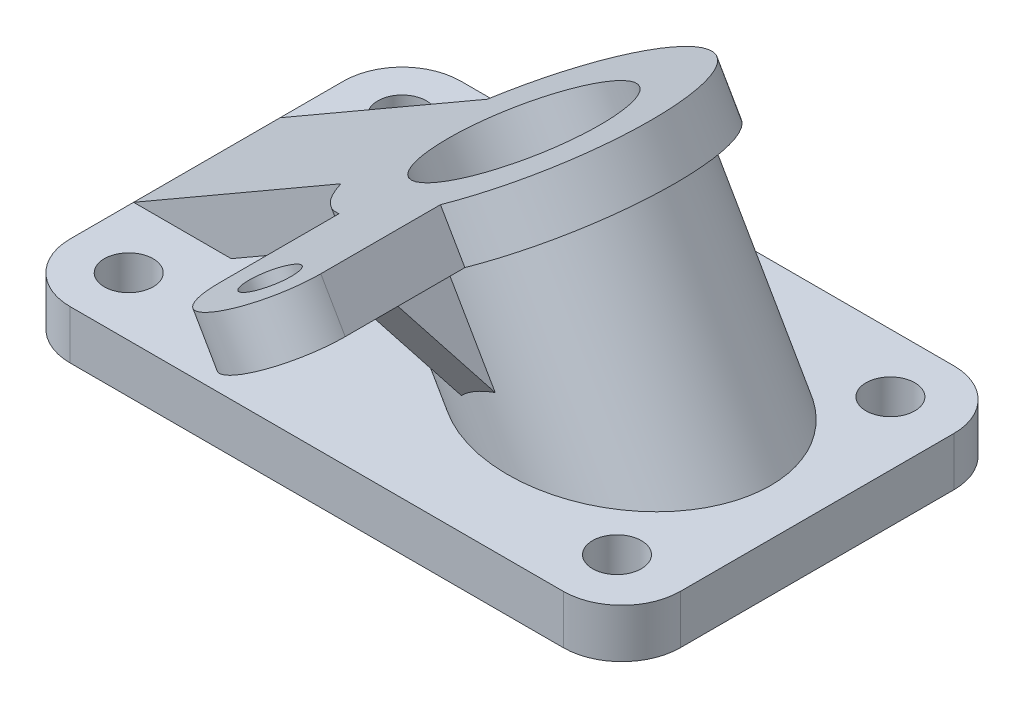
ISO-10303-21;
HEADER;
FILE_DESCRIPTION(('STEP AP214'),'2;1');
FILE_NAME('part.step','',(''),(''),'','','');
FILE_SCHEMA(('AUTOMOTIVE_DESIGN { 1 0 10303 214 1 1 1 1 }'));
ENDSEC;
DATA;
#1=APPLICATION_CONTEXT('core data for automotive mechanical design processes');
#2=APPLICATION_PROTOCOL_DEFINITION('international standard','automotive_design',2000,#1);
#3=PRODUCT_CONTEXT('',#1,'mechanical');
#4=PRODUCT('Part','Part','',(#3));
#5=PRODUCT_RELATED_PRODUCT_CATEGORY('part','',(#4));
#6=PRODUCT_DEFINITION_FORMATION('','',#4);
#7=PRODUCT_DEFINITION_CONTEXT('part definition',#1,'design');
#8=PRODUCT_DEFINITION('design','',#6,#7);
#9=PRODUCT_DEFINITION_SHAPE('','',#8);
#10=(LENGTH_UNIT() NAMED_UNIT(*) SI_UNIT(.MILLI.,.METRE.));
#11=(NAMED_UNIT(*) PLANE_ANGLE_UNIT() SI_UNIT($,.RADIAN.));
#12=(NAMED_UNIT(*) SI_UNIT($,.STERADIAN.) SOLID_ANGLE_UNIT());
#13=UNCERTAINTY_MEASURE_WITH_UNIT(LENGTH_MEASURE(1.E-05),#10,'distance_accuracy_value','');
#14=(GEOMETRIC_REPRESENTATION_CONTEXT(3) GLOBAL_UNCERTAINTY_ASSIGNED_CONTEXT((#13)) GLOBAL_UNIT_ASSIGNED_CONTEXT((#10,
#11,#12)) REPRESENTATION_CONTEXT('',''));
#15=CARTESIAN_POINT('',(0.,0.,0.));
#16=DIRECTION('',(0.,0.,1.));
#17=DIRECTION('',(1.,0.,0.));
#18=AXIS2_PLACEMENT_3D('',#15,#16,#17);
#19=CARTESIAN_POINT('',(-69.7085088742152,10.,-19.2976212814373));
#20=DIRECTION('',(0.,1.,0.));
#21=DIRECTION('',(0.,0.,1.));
#22=AXIS2_PLACEMENT_3D('',#19,#20,#21);
#23=PLANE('',#22);
#24=CARTESIAN_POINT('',(4.89403150419321,9.99999999999091,8.70237871856273));
#25=DIRECTION('',(0.,1.,0.));
#26=DIRECTION('',(-1.,0.,0.));
#27=AXIS2_PLACEMENT_3D('',#24,#25,#26);
#28=ELLIPSE('',#27,28.8675134594813,25.);
#29=CARTESIAN_POINT('',(-23.9734819552881,9.99999999999091,8.70237871856273));
#30=VERTEX_POINT('',#29);
#31=EDGE_CURVE('E349',#30,#30,#28,.T.);
#32=ORIENTED_EDGE('',*,*,#31,.F.);
#33=EDGE_LOOP('',(#32));
#34=FACE_BOUND('',#33,.T.);
#35=DIRECTION('',(-1.,0.,0.));
#36=VECTOR('',#35,1.);
#37=CARTESIAN_POINT('',(-69.7085088742152,10.,-6.29762128143727));
#38=LINE('',#37,#36);
#39=CARTESIAN_POINT('',(-61.7085088742152,10.,-6.29762128143727));
#40=VERTEX_POINT('',#39);
#41=CARTESIAN_POINT('',(-81.7085088742152,10.,-6.29762128143727));
#42=VERTEX_POINT('',#41);
#43=EDGE_CURVE('E261',#40,#42,#38,.T.);
#44=ORIENTED_EDGE('',*,*,#43,.F.);
#45=DIRECTION('',(0.,0.,1.));
#46=VECTOR('',#45,1.);
#47=CARTESIAN_POINT('',(-61.7085088742152,10.,-19.2976212814373));
#48=LINE('',#47,#46);
#49=CARTESIAN_POINT('',(-61.7085088742152,10.,23.7023787185627));
#50=VERTEX_POINT('',#49);
#51=EDGE_CURVE('E58',#40,#50,#48,.T.);
#52=ORIENTED_EDGE('',*,*,#51,.T.);
#53=DIRECTION('',(1.,0.,0.));
#54=VECTOR('',#53,1.);
#55=CARTESIAN_POINT('',(-69.7085088742152,10.,23.7023787185627));
#56=LINE('',#55,#54);
#57=CARTESIAN_POINT('',(-81.7085088742152,9.99999999999999,23.7023787185627));
#58=VERTEX_POINT('',#57);
#59=EDGE_CURVE('E250',#58,#50,#56,.T.);
#60=ORIENTED_EDGE('',*,*,#59,.F.);
#61=DIRECTION('',(0.,0.,1.));
#62=VECTOR('',#61,1.);
#63=CARTESIAN_POINT('',(-81.7085088742152,10.,-19.2976212814372));
#64=LINE('',#63,#62);
#65=CARTESIAN_POINT('',(-81.7085088742152,10.,36.7023787185626));
#66=VERTEX_POINT('',#65);
#67=EDGE_CURVE('E292',#58,#66,#64,.T.);
#68=ORIENTED_EDGE('',*,*,#67,.T.);
#69=CARTESIAN_POINT('',(-69.7085088742152,10.,36.7023787185627));
#70=DIRECTION('',(0.,1.,0.));
#71=DIRECTION('',(0.,0.,1.));
#72=AXIS2_PLACEMENT_3D('',#69,#70,#71);
#73=CIRCLE('',#72,12.);
#74=CARTESIAN_POINT('',(-69.7085088742151,10.,48.7023787185627));
#75=VERTEX_POINT('',#74);
#76=EDGE_CURVE('E297',#66,#75,#73,.T.);
#77=ORIENTED_EDGE('',*,*,#76,.T.);
#78=DIRECTION('',(1.,0.,0.));
#79=VECTOR('',#78,1.);
#80=CARTESIAN_POINT('',(-69.7085088742151,10.,48.7023787185627));
#81=LINE('',#80,#79);
#82=CARTESIAN_POINT('',(31.2914911257847,10.,48.7023787185627));
#83=VERTEX_POINT('',#82);
#84=EDGE_CURVE('E299',#75,#83,#81,.T.);
#85=ORIENTED_EDGE('',*,*,#84,.T.);
#86=CARTESIAN_POINT('',(31.2914911257848,10.,36.7023787185627));
#87=DIRECTION('',(0.,1.,0.));
#88=DIRECTION('',(0.,0.,1.));
#89=AXIS2_PLACEMENT_3D('',#86,#87,#88);
#90=CIRCLE('',#89,12.);
#91=CARTESIAN_POINT('',(43.2914911257848,10.,36.7023787185626));
#92=VERTEX_POINT('',#91);
#93=EDGE_CURVE('E301',#83,#92,#90,.T.);
#94=ORIENTED_EDGE('',*,*,#93,.T.);
#95=DIRECTION('',(0.,0.,-1.));
#96=VECTOR('',#95,1.);
#97=CARTESIAN_POINT('',(43.2914911257848,10.,-19.2976212814372));
#98=LINE('',#97,#96);
#99=CARTESIAN_POINT('',(43.2914911257848,10.,-19.2976212814372));
#100=VERTEX_POINT('',#99);
#101=EDGE_CURVE('E303',#92,#100,#98,.T.);
#102=ORIENTED_EDGE('',*,*,#101,.T.);
#103=CARTESIAN_POINT('',(31.2914911257848,10.,-19.2976212814373));
#104=DIRECTION('',(0.,1.,0.));
#105=DIRECTION('',(0.,0.,1.));
#106=AXIS2_PLACEMENT_3D('',#103,#104,#105);
#107=CIRCLE('',#106,12.);
#108=CARTESIAN_POINT('',(31.2914911257847,10.,-31.2976212814373));
#109=VERTEX_POINT('',#108);
#110=EDGE_CURVE('E305',#100,#109,#107,.T.);
#111=ORIENTED_EDGE('',*,*,#110,.T.);
#112=DIRECTION('',(-1.,0.,0.));
#113=VECTOR('',#112,1.);
#114=CARTESIAN_POINT('',(-69.7085088742151,10.,-31.2976212814373));
#115=LINE('',#114,#113);
#116=CARTESIAN_POINT('',(-69.7085088742151,10.,-31.2976212814373));
#117=VERTEX_POINT('',#116);
#118=EDGE_CURVE('E307',#109,#117,#115,.T.);
#119=ORIENTED_EDGE('',*,*,#118,.T.);
#120=CARTESIAN_POINT('',(-69.7085088742152,10.,-19.2976212814373));
#121=DIRECTION('',(0.,1.,0.));
#122=DIRECTION('',(0.,0.,1.));
#123=AXIS2_PLACEMENT_3D('',#120,#121,#122);
#124=CIRCLE('',#123,12.);
#125=CARTESIAN_POINT('',(-81.7085088742152,10.,-19.2976212814372));
#126=VERTEX_POINT('',#125);
#127=EDGE_CURVE('E289',#117,#126,#124,.T.);
#128=ORIENTED_EDGE('',*,*,#127,.T.);
#129=EDGE_CURVE('E294',#126,#42,#64,.T.);
#130=ORIENTED_EDGE('',*,*,#129,.T.);
#131=EDGE_LOOP('',(#44,#52,#60,#68,#77,#85,#94,#102,#111,#119,#128,#130));
#132=FACE_BOUND('',#131,.T.);
#133=CARTESIAN_POINT('',(30.2914911257846,10.,-19.2976212814373));
#134=DIRECTION('',(0.,1.,0.));
#135=DIRECTION('',(0.,0.,1.));
#136=AXIS2_PLACEMENT_3D('',#133,#134,#135);
#137=CIRCLE('',#136,5.00000000000001);
#138=CARTESIAN_POINT('',(30.2914911257846,10.,-14.2976212814373));
#139=VERTEX_POINT('',#138);
#140=EDGE_CURVE('E271',#139,#139,#137,.T.);
#141=ORIENTED_EDGE('',*,*,#140,.F.);
#142=EDGE_LOOP('',(#141));
#143=FACE_BOUND('',#142,.T.);
#144=CARTESIAN_POINT('',(-69.7085088742152,10.,36.7023787185627));
#145=DIRECTION('',(0.,1.,0.));
#146=DIRECTION('',(0.,0.,1.));
#147=AXIS2_PLACEMENT_3D('',#144,#145,#146);
#148=CIRCLE('',#147,5.00000000000001);
#149=CARTESIAN_POINT('',(-69.7085088742152,10.,41.7023787185627));
#150=VERTEX_POINT('',#149);
#151=EDGE_CURVE('E283',#150,#150,#148,.T.);
#152=ORIENTED_EDGE('',*,*,#151,.F.);
#153=EDGE_LOOP('',(#152));
#154=FACE_BOUND('',#153,.T.);
#155=CARTESIAN_POINT('',(30.2914911257848,10.,36.7023787185627));
#156=DIRECTION('',(0.,1.,0.));
#157=DIRECTION('',(0.,0.,1.));
#158=AXIS2_PLACEMENT_3D('',#155,#156,#157);
#159=CIRCLE('',#158,5.00000000000001);
#160=CARTESIAN_POINT('',(30.2914911257848,10.,41.7023787185627));
#161=VERTEX_POINT('',#160);
#162=EDGE_CURVE('E277',#161,#161,#159,.T.);
#163=ORIENTED_EDGE('',*,*,#162,.F.);
#164=EDGE_LOOP('',(#163));
#165=FACE_BOUND('',#164,.T.);
#166=CARTESIAN_POINT('',(-69.7085088742154,10.,-19.2976212814373));
#167=DIRECTION('',(0.,1.,0.));
#168=DIRECTION('',(0.,0.,1.));
#169=AXIS2_PLACEMENT_3D('',#166,#167,#168);
#170=CIRCLE('',#169,5.00000000000001);
#171=CARTESIAN_POINT('',(-69.7085088742154,10.,-14.2976212814373));
#172=VERTEX_POINT('',#171);
#173=EDGE_CURVE('E265',#172,#172,#170,.T.);
#174=ORIENTED_EDGE('',*,*,#173,.F.);
#175=EDGE_LOOP('',(#174));
#176=FACE_BOUND('',#175,.T.);
#177=ADVANCED_FACE('F35',(#34,#132,#143,#154,#165,#176),#23,.T.);
#178=CARTESIAN_POINT('',(-69.7085088742152,0.,-19.2976212814373));
#179=DIRECTION('',(0.,1.,0.));
#180=DIRECTION('',(0.,0.,1.));
#181=AXIS2_PLACEMENT_3D('',#178,#179,#180);
#182=PLANE('',#181);
#183=CARTESIAN_POINT('',(10.6675341961067,0.,8.70237871856273));
#184=DIRECTION('',(0.,1.,0.));
#185=DIRECTION('',(-1.,0.,0.));
#186=AXIS2_PLACEMENT_3D('',#183,#184,#185);
#187=ELLIPSE('',#186,20.7846096908266,18.);
#188=CARTESIAN_POINT('',(-10.1170754947198,0.,8.70237871856273));
#189=VERTEX_POINT('',#188);
#190=EDGE_CURVE('E193',#189,#189,#187,.T.);
#191=ORIENTED_EDGE('',*,*,#190,.T.);
#192=EDGE_LOOP('',(#191));
#193=FACE_BOUND('',#192,.T.);
#194=CARTESIAN_POINT('',(-69.7085088742152,0.,-19.2976212814373));
#195=DIRECTION('',(0.,1.,0.));
#196=DIRECTION('',(0.,0.,1.));
#197=AXIS2_PLACEMENT_3D('',#194,#195,#196);
#198=CIRCLE('',#197,12.);
#199=CARTESIAN_POINT('',(-69.7085088742151,0.,-31.2976212814373));
#200=VERTEX_POINT('',#199);
#201=CARTESIAN_POINT('',(-81.7085088742152,0.,-19.2976212814372));
#202=VERTEX_POINT('',#201);
#203=EDGE_CURVE('E286',#200,#202,#198,.T.);
#204=ORIENTED_EDGE('',*,*,#203,.F.);
#205=DIRECTION('',(-1.,0.,0.));
#206=VECTOR('',#205,1.);
#207=CARTESIAN_POINT('',(-69.7085088742151,0.,-31.2976212814373));
#208=LINE('',#207,#206);
#209=CARTESIAN_POINT('',(31.2914911257847,0.,-31.2976212814373));
#210=VERTEX_POINT('',#209);
#211=EDGE_CURVE('E293',#210,#200,#208,.T.);
#212=ORIENTED_EDGE('',*,*,#211,.F.);
#213=CARTESIAN_POINT('',(31.2914911257848,0.,-19.2976212814373));
#214=DIRECTION('',(0.,1.,0.));
#215=DIRECTION('',(0.,0.,1.));
#216=AXIS2_PLACEMENT_3D('',#213,#214,#215);
#217=CIRCLE('',#216,12.);
#218=CARTESIAN_POINT('',(43.2914911257848,0.,-19.2976212814372));
#219=VERTEX_POINT('',#218);
#220=EDGE_CURVE('E322',#219,#210,#217,.T.);
#221=ORIENTED_EDGE('',*,*,#220,.F.);
#222=DIRECTION('',(0.,0.,-1.));
#223=VECTOR('',#222,1.);
#224=CARTESIAN_POINT('',(43.2914911257848,0.,-19.2976212814372));
#225=LINE('',#224,#223);
#226=CARTESIAN_POINT('',(43.2914911257848,0.,36.7023787185626));
#227=VERTEX_POINT('',#226);
#228=EDGE_CURVE('E320',#227,#219,#225,.T.);
#229=ORIENTED_EDGE('',*,*,#228,.F.);
#230=CARTESIAN_POINT('',(31.2914911257848,0.,36.7023787185627));
#231=DIRECTION('',(0.,1.,0.));
#232=DIRECTION('',(0.,0.,1.));
#233=AXIS2_PLACEMENT_3D('',#230,#231,#232);
#234=CIRCLE('',#233,12.);
#235=CARTESIAN_POINT('',(31.2914911257847,0.,48.7023787185627));
#236=VERTEX_POINT('',#235);
#237=EDGE_CURVE('E318',#236,#227,#234,.T.);
#238=ORIENTED_EDGE('',*,*,#237,.F.);
#239=DIRECTION('',(1.,0.,0.));
#240=VECTOR('',#239,1.);
#241=CARTESIAN_POINT('',(-69.7085088742151,0.,48.7023787185627));
#242=LINE('',#241,#240);
#243=CARTESIAN_POINT('',(-69.7085088742151,0.,48.7023787185627));
#244=VERTEX_POINT('',#243);
#245=EDGE_CURVE('E316',#244,#236,#242,.T.);
#246=ORIENTED_EDGE('',*,*,#245,.F.);
#247=CARTESIAN_POINT('',(-69.7085088742152,0.,36.7023787185627));
#248=DIRECTION('',(0.,1.,0.));
#249=DIRECTION('',(0.,0.,1.));
#250=AXIS2_PLACEMENT_3D('',#247,#248,#249);
#251=CIRCLE('',#250,12.);
#252=CARTESIAN_POINT('',(-81.7085088742152,0.,36.7023787185626));
#253=VERTEX_POINT('',#252);
#254=EDGE_CURVE('E314',#253,#244,#251,.T.);
#255=ORIENTED_EDGE('',*,*,#254,.F.);
#256=DIRECTION('',(0.,0.,1.));
#257=VECTOR('',#256,1.);
#258=CARTESIAN_POINT('',(-81.7085088742152,0.,-19.2976212814372));
#259=LINE('',#258,#257);
#260=EDGE_CURVE('E312',#202,#253,#259,.T.);
#261=ORIENTED_EDGE('',*,*,#260,.F.);
#262=EDGE_LOOP('',(#204,#212,#221,#229,#238,#246,#255,#261));
#263=FACE_BOUND('',#262,.T.);
#264=CARTESIAN_POINT('',(-69.7085088742152,0.,36.7023787185627));
#265=DIRECTION('',(0.,1.,0.));
#266=DIRECTION('',(0.,0.,1.));
#267=AXIS2_PLACEMENT_3D('',#264,#265,#266);
#268=CIRCLE('',#267,5.00000000000001);
#269=CARTESIAN_POINT('',(-69.7085088742152,0.,41.7023787185627));
#270=VERTEX_POINT('',#269);
#271=EDGE_CURVE('E280',#270,#270,#268,.T.);
#272=ORIENTED_EDGE('',*,*,#271,.T.);
#273=EDGE_LOOP('',(#272));
#274=FACE_BOUND('',#273,.T.);
#275=CARTESIAN_POINT('',(30.2914911257848,0.,36.7023787185627));
#276=DIRECTION('',(0.,1.,0.));
#277=DIRECTION('',(0.,0.,1.));
#278=AXIS2_PLACEMENT_3D('',#275,#276,#277);
#279=CIRCLE('',#278,5.00000000000001);
#280=CARTESIAN_POINT('',(30.2914911257848,0.,41.7023787185627));
#281=VERTEX_POINT('',#280);
#282=EDGE_CURVE('E274',#281,#281,#279,.T.);
#283=ORIENTED_EDGE('',*,*,#282,.T.);
#284=EDGE_LOOP('',(#283));
#285=FACE_BOUND('',#284,.T.);
#286=CARTESIAN_POINT('',(30.2914911257846,0.,-19.2976212814373));
#287=DIRECTION('',(0.,1.,0.));
#288=DIRECTION('',(0.,0.,1.));
#289=AXIS2_PLACEMENT_3D('',#286,#287,#288);
#290=CIRCLE('',#289,5.00000000000001);
#291=CARTESIAN_POINT('',(30.2914911257846,0.,-14.2976212814373));
#292=VERTEX_POINT('',#291);
#293=EDGE_CURVE('E268',#292,#292,#290,.T.);
#294=ORIENTED_EDGE('',*,*,#293,.T.);
#295=EDGE_LOOP('',(#294));
#296=FACE_BOUND('',#295,.T.);
#297=CARTESIAN_POINT('',(-69.7085088742154,0.,-19.2976212814373));
#298=DIRECTION('',(0.,1.,0.));
#299=DIRECTION('',(0.,0.,1.));
#300=AXIS2_PLACEMENT_3D('',#297,#298,#299);
#301=CIRCLE('',#300,5.00000000000001);
#302=CARTESIAN_POINT('',(-69.7085088742154,0.,-14.2976212814373));
#303=VERTEX_POINT('',#302);
#304=EDGE_CURVE('E264',#303,#303,#301,.T.);
#305=ORIENTED_EDGE('',*,*,#304,.T.);
#306=EDGE_LOOP('',(#305));
#307=FACE_BOUND('',#306,.T.);
#308=ADVANCED_FACE('F366',(#193,#263,#274,#285,#296,#307),#182,.F.);
#309=CARTESIAN_POINT('',(-69.7085088742152,10.,-19.2976212814373));
#310=DIRECTION('',(0.,-1.,0.));
#311=DIRECTION('',(0.,0.,-1.));
#312=AXIS2_PLACEMENT_3D('',#309,#310,#311);
#313=CYLINDRICAL_SURFACE('',#312,12.);
#314=ORIENTED_EDGE('',*,*,#203,.T.);
#315=DIRECTION('',(0.,-1.,0.));
#316=VECTOR('',#315,1.);
#317=CARTESIAN_POINT('',(-81.7085088742152,10.,-19.2976212814372));
#318=LINE('',#317,#316);
#319=EDGE_CURVE('E345',#126,#202,#318,.T.);
#320=ORIENTED_EDGE('',*,*,#319,.F.);
#321=ORIENTED_EDGE('',*,*,#127,.F.);
#322=DIRECTION('',(0.,-1.,0.));
#323=VECTOR('',#322,1.);
#324=CARTESIAN_POINT('',(-69.7085088742151,10.,-31.2976212814373));
#325=LINE('',#324,#323);
#326=EDGE_CURVE('E309',#117,#200,#325,.T.);
#327=ORIENTED_EDGE('',*,*,#326,.T.);
#328=EDGE_LOOP('',(#314,#320,#321,#327));
#329=FACE_BOUND('',#328,.T.);
#330=ADVANCED_FACE('F37',(#329),#313,.T.);
#331=CARTESIAN_POINT('',(-81.7085088742152,10.,-19.2976212814372));
#332=DIRECTION('',(1.,0.,0.));
#333=DIRECTION('',(0.,0.,-1.));
#334=AXIS2_PLACEMENT_3D('',#331,#332,#333);
#335=PLANE('',#334);
#336=ORIENTED_EDGE('',*,*,#260,.T.);
#337=DIRECTION('',(0.,-1.,0.));
#338=VECTOR('',#337,1.);
#339=CARTESIAN_POINT('',(-81.7085088742152,10.,36.7023787185626));
#340=LINE('',#339,#338);
#341=EDGE_CURVE('E342',#66,#253,#340,.T.);
#342=ORIENTED_EDGE('',*,*,#341,.F.);
#343=ORIENTED_EDGE('',*,*,#67,.F.);
#344=DIRECTION('',(0.,0.,1.));
#345=VECTOR('',#344,1.);
#346=CARTESIAN_POINT('',(-81.7085088742152,9.99999999999999,-6.29762128143727));
#347=LINE('',#346,#345);
#348=EDGE_CURVE('E201',#42,#58,#347,.T.);
#349=ORIENTED_EDGE('',*,*,#348,.F.);
#350=ORIENTED_EDGE('',*,*,#129,.F.);
#351=ORIENTED_EDGE('',*,*,#319,.T.);
#352=EDGE_LOOP('',(#336,#342,#343,#349,#350,#351));
#353=FACE_BOUND('',#352,.T.);
#354=ADVANCED_FACE('F401',(#353),#335,.F.);
#355=CARTESIAN_POINT('',(-69.7085088742152,10.,36.7023787185627));
#356=DIRECTION('',(0.,-1.,0.));
#357=DIRECTION('',(0.,0.,-1.));
#358=AXIS2_PLACEMENT_3D('',#355,#356,#357);
#359=CYLINDRICAL_SURFACE('',#358,12.);
#360=ORIENTED_EDGE('',*,*,#254,.T.);
#361=DIRECTION('',(0.,-1.,0.));
#362=VECTOR('',#361,1.);
#363=CARTESIAN_POINT('',(-69.7085088742151,10.,48.7023787185627));
#364=LINE('',#363,#362);
#365=EDGE_CURVE('E339',#75,#244,#364,.T.);
#366=ORIENTED_EDGE('',*,*,#365,.F.);
#367=ORIENTED_EDGE('',*,*,#76,.F.);
#368=ORIENTED_EDGE('',*,*,#341,.T.);
#369=EDGE_LOOP('',(#360,#366,#367,#368));
#370=FACE_BOUND('',#369,.T.);
#371=ADVANCED_FACE('F398',(#370),#359,.T.);
#372=CARTESIAN_POINT('',(-69.7085088742151,10.,48.7023787185627));
#373=DIRECTION('',(0.,0.,-1.));
#374=DIRECTION('',(-1.,0.,0.));
#375=AXIS2_PLACEMENT_3D('',#372,#373,#374);
#376=PLANE('',#375);
#377=ORIENTED_EDGE('',*,*,#245,.T.);
#378=DIRECTION('',(0.,-1.,0.));
#379=VECTOR('',#378,1.);
#380=CARTESIAN_POINT('',(31.2914911257847,10.,48.7023787185627));
#381=LINE('',#380,#379);
#382=EDGE_CURVE('E336',#83,#236,#381,.T.);
#383=ORIENTED_EDGE('',*,*,#382,.F.);
#384=ORIENTED_EDGE('',*,*,#84,.F.);
#385=ORIENTED_EDGE('',*,*,#365,.T.);
#386=EDGE_LOOP('',(#377,#383,#384,#385));
#387=FACE_BOUND('',#386,.T.);
#388=ADVANCED_FACE('F394',(#387),#376,.F.);
#389=CARTESIAN_POINT('',(31.2914911257848,10.,36.7023787185627));
#390=DIRECTION('',(0.,-1.,0.));
#391=DIRECTION('',(0.,0.,-1.));
#392=AXIS2_PLACEMENT_3D('',#389,#390,#391);
#393=CYLINDRICAL_SURFACE('',#392,12.);
#394=ORIENTED_EDGE('',*,*,#237,.T.);
#395=DIRECTION('',(0.,-1.,0.));
#396=VECTOR('',#395,1.);
#397=CARTESIAN_POINT('',(43.2914911257848,10.,36.7023787185626));
#398=LINE('',#397,#396);
#399=EDGE_CURVE('E333',#92,#227,#398,.T.);
#400=ORIENTED_EDGE('',*,*,#399,.F.);
#401=ORIENTED_EDGE('',*,*,#93,.F.);
#402=ORIENTED_EDGE('',*,*,#382,.T.);
#403=EDGE_LOOP('',(#394,#400,#401,#402));
#404=FACE_BOUND('',#403,.T.);
#405=ADVANCED_FACE('F390',(#404),#393,.T.);
#406=CARTESIAN_POINT('',(43.2914911257848,10.,-19.2976212814372));
#407=DIRECTION('',(-1.,0.,0.));
#408=DIRECTION('',(0.,0.,1.));
#409=AXIS2_PLACEMENT_3D('',#406,#407,#408);
#410=PLANE('',#409);
#411=ORIENTED_EDGE('',*,*,#228,.T.);
#412=DIRECTION('',(0.,-1.,0.));
#413=VECTOR('',#412,1.);
#414=CARTESIAN_POINT('',(43.2914911257848,10.,-19.2976212814372));
#415=LINE('',#414,#413);
#416=EDGE_CURVE('E330',#100,#219,#415,.T.);
#417=ORIENTED_EDGE('',*,*,#416,.F.);
#418=ORIENTED_EDGE('',*,*,#101,.F.);
#419=ORIENTED_EDGE('',*,*,#399,.T.);
#420=EDGE_LOOP('',(#411,#417,#418,#419));
#421=FACE_BOUND('',#420,.T.);
#422=ADVANCED_FACE('F386',(#421),#410,.F.);
#423=CARTESIAN_POINT('',(31.2914911257848,10.,-19.2976212814373));
#424=DIRECTION('',(0.,-1.,0.));
#425=DIRECTION('',(0.,0.,-1.));
#426=AXIS2_PLACEMENT_3D('',#423,#424,#425);
#427=CYLINDRICAL_SURFACE('',#426,12.);
#428=ORIENTED_EDGE('',*,*,#220,.T.);
#429=DIRECTION('',(0.,-1.,0.));
#430=VECTOR('',#429,1.);
#431=CARTESIAN_POINT('',(31.2914911257847,10.,-31.2976212814373));
#432=LINE('',#431,#430);
#433=EDGE_CURVE('E327',#109,#210,#432,.T.);
#434=ORIENTED_EDGE('',*,*,#433,.F.);
#435=ORIENTED_EDGE('',*,*,#110,.F.);
#436=ORIENTED_EDGE('',*,*,#416,.T.);
#437=EDGE_LOOP('',(#428,#434,#435,#436));
#438=FACE_BOUND('',#437,.T.);
#439=ADVANCED_FACE('F382',(#438),#427,.T.);
#440=CARTESIAN_POINT('',(-69.7085088742151,10.,-31.2976212814373));
#441=DIRECTION('',(0.,0.,1.));
#442=DIRECTION('',(1.,0.,0.));
#443=AXIS2_PLACEMENT_3D('',#440,#441,#442);
#444=PLANE('',#443);
#445=ORIENTED_EDGE('',*,*,#211,.T.);
#446=ORIENTED_EDGE('',*,*,#326,.F.);
#447=ORIENTED_EDGE('',*,*,#118,.F.);
#448=ORIENTED_EDGE('',*,*,#433,.T.);
#449=EDGE_LOOP('',(#445,#446,#447,#448));
#450=FACE_BOUND('',#449,.T.);
#451=ADVANCED_FACE('F379',(#450),#444,.F.);
#452=CARTESIAN_POINT('',(-69.7085088742152,10.,36.7023787185627));
#453=DIRECTION('',(0.,-1.,0.));
#454=DIRECTION('',(0.,0.,-1.));
#455=AXIS2_PLACEMENT_3D('',#452,#453,#454);
#456=CYLINDRICAL_SURFACE('',#455,5.00000000000001);
#457=ORIENTED_EDGE('',*,*,#151,.T.);
#458=EDGE_LOOP('',(#457));
#459=FACE_BOUND('',#458,.T.);
#460=ORIENTED_EDGE('',*,*,#271,.F.);
#461=EDGE_LOOP('',(#460));
#462=FACE_BOUND('',#461,.T.);
#463=ADVANCED_FACE('F376',(#459,#462),#456,.F.);
#464=CARTESIAN_POINT('',(30.2914911257848,10.,36.7023787185627));
#465=DIRECTION('',(0.,-1.,0.));
#466=DIRECTION('',(0.,0.,-1.));
#467=AXIS2_PLACEMENT_3D('',#464,#465,#466);
#468=CYLINDRICAL_SURFACE('',#467,5.00000000000001);
#469=ORIENTED_EDGE('',*,*,#162,.T.);
#470=EDGE_LOOP('',(#469));
#471=FACE_BOUND('',#470,.T.);
#472=ORIENTED_EDGE('',*,*,#282,.F.);
#473=EDGE_LOOP('',(#472));
#474=FACE_BOUND('',#473,.T.);
#475=ADVANCED_FACE('F482',(#471,#474),#468,.F.);
#476=CARTESIAN_POINT('',(30.2914911257846,10.,-19.2976212814373));
#477=DIRECTION('',(0.,-1.,0.));
#478=DIRECTION('',(0.,0.,-1.));
#479=AXIS2_PLACEMENT_3D('',#476,#477,#478);
#480=CYLINDRICAL_SURFACE('',#479,5.00000000000001);
#481=ORIENTED_EDGE('',*,*,#140,.T.);
#482=EDGE_LOOP('',(#481));
#483=FACE_BOUND('',#482,.T.);
#484=ORIENTED_EDGE('',*,*,#293,.F.);
#485=EDGE_LOOP('',(#484));
#486=FACE_BOUND('',#485,.T.);
#487=ADVANCED_FACE('F479',(#483,#486),#480,.F.);
#488=CARTESIAN_POINT('',(-69.7085088742154,10.,-19.2976212814373));
#489=DIRECTION('',(0.,-1.,0.));
#490=DIRECTION('',(0.,0.,-1.));
#491=AXIS2_PLACEMENT_3D('',#488,#489,#490);
#492=CYLINDRICAL_SURFACE('',#491,5.00000000000001);
#493=ORIENTED_EDGE('',*,*,#173,.T.);
#494=EDGE_LOOP('',(#493));
#495=FACE_BOUND('',#494,.T.);
#496=ORIENTED_EDGE('',*,*,#304,.F.);
#497=EDGE_LOOP('',(#496));
#498=FACE_BOUND('',#497,.T.);
#499=ADVANCED_FACE('F476',(#495,#498),#492,.F.);
#500=CARTESIAN_POINT('',(-76.7085088742152,1.33974596215561,-6.29762128143727));
#501=DIRECTION('',(0.,0.,-1.));
#502=DIRECTION('',(-1.,0.,0.));
#503=AXIS2_PLACEMENT_3D('',#500,#501,#502);
#504=PLANE('',#503);
#505=DIRECTION('',(-0.866025403784438,-0.500000000000001,0.));
#506=VECTOR('',#505,1.);
#507=CARTESIAN_POINT('',(-76.7085088742152,1.33974596215561,-6.29762128143727));
#508=LINE('',#507,#506);
#509=CARTESIAN_POINT('',(-34.2566035903823,25.8493649053891,-6.29762128143728));
#510=VERTEX_POINT('',#509);
#511=EDGE_CURVE('E222',#510,#40,#508,.T.);
#512=ORIENTED_EDGE('',*,*,#511,.T.);
#513=ORIENTED_EDGE('',*,*,#43,.T.);
#514=DIRECTION('',(-0.866025403784438,-0.500000000000001,0.));
#515=VECTOR('',#514,1.);
#516=CARTESIAN_POINT('',(-81.7085088742152,9.99999999999999,-6.29762128143727));
#517=LINE('',#516,#515);
#518=CARTESIAN_POINT('',(-39.2566035903823,34.5096189432335,-6.29762128143728));
#519=VERTEX_POINT('',#518);
#520=EDGE_CURVE('E207',#519,#42,#517,.T.);
#521=ORIENTED_EDGE('',*,*,#520,.F.);
#522=DIRECTION('',(-0.500000000000001,0.866025403784438,0.));
#523=VECTOR('',#522,1.);
#524=CARTESIAN_POINT('',(-34.2566035903823,25.8493649053891,-6.29762128143728));
#525=LINE('',#524,#523);
#526=EDGE_CURVE('E248',#510,#519,#525,.T.);
#527=ORIENTED_EDGE('',*,*,#526,.F.);
#528=EDGE_LOOP('',(#512,#513,#521,#527));
#529=FACE_BOUND('',#528,.T.);
#530=ADVANCED_FACE('F432',(#529),#504,.T.);
#531=CARTESIAN_POINT('',(-11.7566035903823,38.8397459621557,8.70237871856273));
#532=DIRECTION('',(-0.500000000000001,0.866025403784438,0.));
#533=DIRECTION('',(-0.866025403784438,-0.500000000000001,0.));
#534=AXIS2_PLACEMENT_3D('',#531,#532,#533);
#535=CYLINDRICAL_SURFACE('',#534,30.);
#536=CARTESIAN_POINT('',(-16.7566035903823,47.5000000000001,8.70237871856273));
#537=DIRECTION('',(-0.500000000000001,0.866025403784438,0.));
#538=DIRECTION('',(-0.866025403784438,-0.500000000000001,0.));
#539=AXIS2_PLACEMENT_3D('',#536,#537,#538);
#540=CIRCLE('',#539,30.);
#541=CARTESIAN_POINT('',(-6.36429874496909,53.5000000000001,36.1978328882978));
#542=VERTEX_POINT('',#541);
#543=EDGE_CURVE('E243',#542,#519,#540,.T.);
#544=ORIENTED_EDGE('',*,*,#543,.F.);
#545=DIRECTION('',(-0.500000000000001,0.866025403784438,0.));
#546=VECTOR('',#545,1.);
#547=CARTESIAN_POINT('',(-1.36429874496908,44.8397459621557,36.1978328882978));
#548=LINE('',#547,#546);
#549=CARTESIAN_POINT('',(-1.36429874496908,44.8397459621557,36.1978328882978));
#550=VERTEX_POINT('',#549);
#551=EDGE_CURVE('E251',#550,#542,#548,.T.);
#552=ORIENTED_EDGE('',*,*,#551,.F.);
#553=CARTESIAN_POINT('',(-11.7566035903823,38.8397459621557,8.70237871856273));
#554=DIRECTION('',(-0.500000000000001,0.866025403784438,0.));
#555=DIRECTION('',(-0.866025403784438,-0.500000000000001,0.));
#556=AXIS2_PLACEMENT_3D('',#553,#554,#555);
#557=CIRCLE('',#556,30.);
#558=EDGE_CURVE('E219',#550,#510,#557,.T.);
#559=ORIENTED_EDGE('',*,*,#558,.T.);
#560=ORIENTED_EDGE('',*,*,#526,.T.);
#561=EDGE_LOOP('',(#544,#552,#559,#560));
#562=FACE_BOUND('',#561,.T.);
#563=ADVANCED_FACE('F438',(#562),#535,.T.);
#564=CARTESIAN_POINT('',(-1.36429874496908,44.8397459621557,36.1978328882978));
#565=DIRECTION('',(0.866025403784438,0.500000000000001,0.));
#566=DIRECTION('',(-0.500000000000001,0.866025403784438,0.));
#567=AXIS2_PLACEMENT_3D('',#564,#565,#566);
#568=PLANE('',#567);
#569=DIRECTION('',(0.,0.,-1.));
#570=VECTOR('',#569,1.);
#571=CARTESIAN_POINT('',(-6.36429874496909,53.5000000000001,36.1978328882978));
#572=LINE('',#571,#570);
#573=CARTESIAN_POINT('',(-6.36429874496909,53.5000000000001,60.7023787185627));
#574=VERTEX_POINT('',#573);
#575=EDGE_CURVE('E240',#574,#542,#572,.T.);
#576=ORIENTED_EDGE('',*,*,#575,.F.);
#577=DIRECTION('',(-0.500000000000001,0.866025403784438,0.));
#578=VECTOR('',#577,1.);
#579=CARTESIAN_POINT('',(-1.36429874496908,44.8397459621557,60.7023787185627));
#580=LINE('',#579,#578);
#581=CARTESIAN_POINT('',(-1.36429874496908,44.8397459621557,60.7023787185627));
#582=VERTEX_POINT('',#581);
#583=EDGE_CURVE('E253',#582,#574,#580,.T.);
#584=ORIENTED_EDGE('',*,*,#583,.F.);
#585=DIRECTION('',(0.,0.,-1.));
#586=VECTOR('',#585,1.);
#587=CARTESIAN_POINT('',(-1.36429874496908,44.8397459621557,36.1978328882978));
#588=LINE('',#587,#586);
#589=EDGE_CURVE('E216',#582,#550,#588,.T.);
#590=ORIENTED_EDGE('',*,*,#589,.T.);
#591=ORIENTED_EDGE('',*,*,#551,.T.);
#592=EDGE_LOOP('',(#576,#584,#590,#591));
#593=FACE_BOUND('',#592,.T.);
#594=ADVANCED_FACE('F459',(#593),#568,.T.);
#595=CARTESIAN_POINT('',(-11.7566035903823,38.8397459621557,60.7023787185627));
#596=DIRECTION('',(-0.500000000000001,0.866025403784438,0.));
#597=DIRECTION('',(-0.866025403784438,-0.500000000000001,0.));
#598=AXIS2_PLACEMENT_3D('',#595,#596,#597);
#599=CYLINDRICAL_SURFACE('',#598,12.);
#600=CARTESIAN_POINT('',(-16.7566035903823,47.5000000000001,60.7023787185627));
#601=DIRECTION('',(-0.500000000000001,0.866025403784438,0.));
#602=DIRECTION('',(0.866025403784438,0.500000000000001,0.));
#603=AXIS2_PLACEMENT_3D('',#600,#601,#602);
#604=CIRCLE('',#603,12.);
#605=CARTESIAN_POINT('',(-27.1489084357956,41.5000000000001,60.7023787185627));
#606=VERTEX_POINT('',#605);
#607=EDGE_CURVE('E237',#606,#574,#604,.T.);
#608=ORIENTED_EDGE('',*,*,#607,.F.);
#609=DIRECTION('',(-0.500000000000001,0.866025403784438,0.));
#610=VECTOR('',#609,1.);
#611=CARTESIAN_POINT('',(-22.1489084357956,32.8397459621557,60.7023787185627));
#612=LINE('',#611,#610);
#613=CARTESIAN_POINT('',(-22.1489084357956,32.8397459621557,60.7023787185627));
#614=VERTEX_POINT('',#613);
#615=EDGE_CURVE('E255',#614,#606,#612,.T.);
#616=ORIENTED_EDGE('',*,*,#615,.F.);
#617=CARTESIAN_POINT('',(-11.7566035903823,38.8397459621557,60.7023787185627));
#618=DIRECTION('',(-0.500000000000001,0.866025403784438,0.));
#619=DIRECTION('',(0.866025403784438,0.500000000000001,0.));
#620=AXIS2_PLACEMENT_3D('',#617,#618,#619);
#621=CIRCLE('',#620,12.);
#622=EDGE_CURVE('E213',#614,#582,#621,.T.);
#623=ORIENTED_EDGE('',*,*,#622,.T.);
#624=ORIENTED_EDGE('',*,*,#583,.T.);
#625=EDGE_LOOP('',(#608,#616,#623,#624));
#626=FACE_BOUND('',#625,.T.);
#627=ADVANCED_FACE('F457',(#626),#599,.T.);
#628=CARTESIAN_POINT('',(-22.1489084357956,32.8397459621557,36.1978328882978));
#629=DIRECTION('',(-0.866025403784438,-0.500000000000001,0.));
#630=DIRECTION('',(0.500000000000001,-0.866025403784438,0.));
#631=AXIS2_PLACEMENT_3D('',#628,#629,#630);
#632=PLANE('',#631);
#633=DIRECTION('',(0.,0.,1.));
#634=VECTOR('',#633,1.);
#635=CARTESIAN_POINT('',(-27.1489084357956,41.5000000000001,36.1978328882978));
#636=LINE('',#635,#634);
#637=CARTESIAN_POINT('',(-27.1489084357956,41.5000000000001,36.1978328882978));
#638=VERTEX_POINT('',#637);
#639=EDGE_CURVE('E234',#638,#606,#636,.T.);
#640=ORIENTED_EDGE('',*,*,#639,.F.);
#641=DIRECTION('',(-0.500000000000001,0.866025403784438,0.));
#642=VECTOR('',#641,1.);
#643=CARTESIAN_POINT('',(-22.1489084357956,32.8397459621557,36.1978328882978));
#644=LINE('',#643,#642);
#645=CARTESIAN_POINT('',(-22.1489084357956,32.8397459621557,36.1978328882978));
#646=VERTEX_POINT('',#645);
#647=EDGE_CURVE('E257',#646,#638,#644,.T.);
#648=ORIENTED_EDGE('',*,*,#647,.F.);
#649=DIRECTION('',(0.,0.,1.));
#650=VECTOR('',#649,1.);
#651=CARTESIAN_POINT('',(-22.1489084357956,32.8397459621557,36.1978328882978));
#652=LINE('',#651,#650);
#653=EDGE_CURVE('E210',#646,#614,#652,.T.);
#654=ORIENTED_EDGE('',*,*,#653,.T.);
#655=ORIENTED_EDGE('',*,*,#615,.T.);
#656=EDGE_LOOP('',(#640,#648,#654,#655));
#657=FACE_BOUND('',#656,.T.);
#658=ADVANCED_FACE('F454',(#657),#632,.T.);
#659=CARTESIAN_POINT('',(-11.7566035903823,38.8397459621557,8.70237871856273));
#660=DIRECTION('',(-0.500000000000001,0.866025403784438,0.));
#661=DIRECTION('',(-0.866025403784438,-0.500000000000001,0.));
#662=AXIS2_PLACEMENT_3D('',#659,#660,#661);
#663=CYLINDRICAL_SURFACE('',#662,30.);
#664=CARTESIAN_POINT('',(-16.7566035903823,47.5000000000001,8.70237871856273));
#665=DIRECTION('',(-0.500000000000001,0.866025403784438,0.));
#666=DIRECTION('',(-0.866025403784438,-0.500000000000001,0.));
#667=AXIS2_PLACEMENT_3D('',#664,#665,#666);
#668=CIRCLE('',#667,30.);
#669=CARTESIAN_POINT('',(-39.2566035903823,34.5096189432335,23.7023787185627));
#670=VERTEX_POINT('',#669);
#671=EDGE_CURVE('E231',#670,#638,#668,.T.);
#672=ORIENTED_EDGE('',*,*,#671,.F.);
#673=DIRECTION('',(-0.500000000000001,0.866025403784438,0.));
#674=VECTOR('',#673,1.);
#675=CARTESIAN_POINT('',(-34.2566035903823,25.8493649053891,23.7023787185627));
#676=LINE('',#675,#674);
#677=CARTESIAN_POINT('',(-34.2566035903823,25.8493649053891,23.7023787185627));
#678=VERTEX_POINT('',#677);
#679=EDGE_CURVE('E225',#678,#670,#676,.T.);
#680=ORIENTED_EDGE('',*,*,#679,.F.);
#681=CARTESIAN_POINT('',(-11.7566035903823,38.8397459621557,8.70237871856273));
#682=DIRECTION('',(-0.500000000000001,0.866025403784438,0.));
#683=DIRECTION('',(-0.866025403784438,-0.500000000000001,0.));
#684=AXIS2_PLACEMENT_3D('',#681,#682,#683);
#685=CIRCLE('',#684,30.);
#686=EDGE_CURVE('E206',#678,#646,#685,.T.);
#687=ORIENTED_EDGE('',*,*,#686,.T.);
#688=ORIENTED_EDGE('',*,*,#647,.T.);
#689=EDGE_LOOP('',(#672,#680,#687,#688));
#690=FACE_BOUND('',#689,.T.);
#691=ADVANCED_FACE('F450',(#690),#663,.T.);
#692=CARTESIAN_POINT('',(-76.7085088742152,1.33974596215561,23.7023787185627));
#693=DIRECTION('',(0.,0.,1.));
#694=DIRECTION('',(1.,0.,0.));
#695=AXIS2_PLACEMENT_3D('',#692,#693,#694);
#696=PLANE('',#695);
#697=DIRECTION('',(0.866025403784438,0.500000000000001,0.));
#698=VECTOR('',#697,1.);
#699=CARTESIAN_POINT('',(-81.7085088742152,9.99999999999999,23.7023787185627));
#700=LINE('',#699,#698);
#701=EDGE_CURVE('E228',#58,#670,#700,.T.);
#702=ORIENTED_EDGE('',*,*,#701,.F.);
#703=ORIENTED_EDGE('',*,*,#59,.T.);
#704=DIRECTION('',(0.866025403784438,0.500000000000001,0.));
#705=VECTOR('',#704,1.);
#706=CARTESIAN_POINT('',(-76.7085088742152,1.33974596215561,23.7023787185627));
#707=LINE('',#706,#705);
#708=EDGE_CURVE('E204',#50,#678,#707,.T.);
#709=ORIENTED_EDGE('',*,*,#708,.T.);
#710=ORIENTED_EDGE('',*,*,#679,.T.);
#711=EDGE_LOOP('',(#702,#703,#709,#710));
#712=FACE_BOUND('',#711,.T.);
#713=ADVANCED_FACE('F447',(#712),#696,.T.);
#714=CARTESIAN_POINT('',(-11.7566035903823,38.8397459621557,8.70237871856273));
#715=DIRECTION('',(-0.500000000000001,0.866025403784438,0.));
#716=DIRECTION('',(-0.866025403784438,-0.500000000000001,0.));
#717=AXIS2_PLACEMENT_3D('',#714,#715,#716);
#718=PLANE('',#717);
#719=CARTESIAN_POINT('',(-11.7566035903565,38.8397459620364,8.70237871856273));
#720=DIRECTION('',(-0.500000000000001,0.866025403784438,0.));
#721=DIRECTION('',(-0.866025403784438,-0.500000000000001,0.));
#722=AXIS2_PLACEMENT_3D('',#719,#720,#721);
#723=CIRCLE('',#722,25.);
#724=CARTESIAN_POINT('',(-15.2207052054692,36.8397459620509,33.3803040770509));
#725=VERTEX_POINT('',#724);
#726=CARTESIAN_POINT('',(-8.29250197519367,40.8397459620509,33.3803040770896));
#727=VERTEX_POINT('',#726);
#728=EDGE_CURVE('E185',#725,#727,#723,.F.);
#729=ORIENTED_EDGE('',*,*,#728,.F.);
#730=DIRECTION('',(-2.63741386265529E-13,-1.51617251312714E-13,-1.));
#731=VECTOR('',#730,1.);
#732=CARTESIAN_POINT('',(-15.220705205466,36.8397459620527,45.2977209007754));
#733=LINE('',#732,#731);
#734=CARTESIAN_POINT('',(-15.220705205466,36.8397459620527,45.2977209007754));
#735=VERTEX_POINT('',#734);
#736=EDGE_CURVE('E178',#735,#725,#733,.T.);
#737=ORIENTED_EDGE('',*,*,#736,.F.);
#738=DIRECTION('',(0.866025403784438,0.500000000000001,-3.04421710219233E-13));
#739=VECTOR('',#738,1.);
#740=CARTESIAN_POINT('',(-15.220705205466,36.8397459620527,45.2977209007754));
#741=LINE('',#740,#739);
#742=CARTESIAN_POINT('',(-8.29250197519053,40.8397459620527,45.297720900773));
#743=VERTEX_POINT('',#742);
#744=EDGE_CURVE('E166',#735,#743,#741,.T.);
#745=ORIENTED_EDGE('',*,*,#744,.T.);
#746=DIRECTION('',(-2.63741386265529E-13,-1.51617251312714E-13,-1.));
#747=VECTOR('',#746,1.);
#748=CARTESIAN_POINT('',(-8.29250197519053,40.8397459620527,45.297720900773));
#749=LINE('',#748,#747);
#750=EDGE_CURVE('E187',#743,#727,#749,.T.);
#751=ORIENTED_EDGE('',*,*,#750,.T.);
#752=EDGE_LOOP('',(#729,#737,#745,#751));
#753=FACE_BOUND('',#752,.T.);
#754=ORIENTED_EDGE('',*,*,#51,.F.);
#755=ORIENTED_EDGE('',*,*,#511,.F.);
#756=ORIENTED_EDGE('',*,*,#558,.F.);
#757=ORIENTED_EDGE('',*,*,#589,.F.);
#758=ORIENTED_EDGE('',*,*,#622,.F.);
#759=ORIENTED_EDGE('',*,*,#653,.F.);
#760=ORIENTED_EDGE('',*,*,#686,.F.);
#761=ORIENTED_EDGE('',*,*,#708,.F.);
#762=EDGE_LOOP('',(#754,#755,#756,#757,#758,#759,#760,#761));
#763=FACE_BOUND('',#762,.T.);
#764=CARTESIAN_POINT('',(-11.7566035903823,38.8397459621557,60.7023787185627));
#765=DIRECTION('',(-0.500000000000001,0.866025403784438,0.));
#766=DIRECTION('',(-0.866025403784438,-0.500000000000001,0.));
#767=AXIS2_PLACEMENT_3D('',#764,#765,#766);
#768=CIRCLE('',#767,5.);
#769=CARTESIAN_POINT('',(-16.0867306093045,36.3397459621557,60.7023787185627));
#770=VERTEX_POINT('',#769);
#771=EDGE_CURVE('E198',#770,#770,#768,.T.);
#772=ORIENTED_EDGE('',*,*,#771,.T.);
#773=EDGE_LOOP('',(#772));
#774=FACE_BOUND('',#773,.T.);
#775=ADVANCED_FACE('F182',(#753,#763,#774),#718,.F.);
#776=CARTESIAN_POINT('',(-16.7566035903823,47.5000000000001,8.70237871856273));
#777=DIRECTION('',(-0.500000000000001,0.866025403784438,0.));
#778=DIRECTION('',(-0.866025403784438,-0.500000000000001,0.));
#779=AXIS2_PLACEMENT_3D('',#776,#777,#778);
#780=PLANE('',#779);
#781=CARTESIAN_POINT('',(-16.7566035903961,47.4999999999922,8.70237871856273));
#782=DIRECTION('',(-0.500000000000001,0.866025403784438,0.));
#783=DIRECTION('',(-0.866025403784438,-0.500000000000001,0.));
#784=AXIS2_PLACEMENT_3D('',#781,#782,#783);
#785=CIRCLE('',#784,18.);
#786=CARTESIAN_POINT('',(-32.345060858516,38.4999999999921,8.70237871856273));
#787=VERTEX_POINT('',#786);
#788=EDGE_CURVE('E174',#787,#787,#785,.T.);
#789=ORIENTED_EDGE('',*,*,#788,.F.);
#790=EDGE_LOOP('',(#789));
#791=FACE_BOUND('',#790,.T.);
#792=CARTESIAN_POINT('',(-16.7566035903823,47.5000000000001,60.7023787185627));
#793=DIRECTION('',(-0.500000000000001,0.866025403784438,0.));
#794=DIRECTION('',(-0.866025403784438,-0.500000000000001,0.));
#795=AXIS2_PLACEMENT_3D('',#792,#793,#794);
#796=CIRCLE('',#795,5.);
#797=CARTESIAN_POINT('',(-21.0867306093045,45.0000000000001,60.7023787185627));
#798=VERTEX_POINT('',#797);
#799=EDGE_CURVE('E197',#798,#798,#796,.T.);
#800=ORIENTED_EDGE('',*,*,#799,.F.);
#801=EDGE_LOOP('',(#800));
#802=FACE_BOUND('',#801,.T.);
#803=ORIENTED_EDGE('',*,*,#348,.T.);
#804=ORIENTED_EDGE('',*,*,#701,.T.);
#805=ORIENTED_EDGE('',*,*,#671,.T.);
#806=ORIENTED_EDGE('',*,*,#639,.T.);
#807=ORIENTED_EDGE('',*,*,#607,.T.);
#808=ORIENTED_EDGE('',*,*,#575,.T.);
#809=ORIENTED_EDGE('',*,*,#543,.T.);
#810=ORIENTED_EDGE('',*,*,#520,.T.);
#811=EDGE_LOOP('',(#803,#804,#805,#806,#807,#808,#809,#810));
#812=FACE_BOUND('',#811,.T.);
#813=ADVANCED_FACE('F434',(#791,#802,#812),#780,.T.);
#814=CARTESIAN_POINT('',(-11.7566035903823,38.8397459621557,60.7023787185627));
#815=DIRECTION('',(-0.500000000000001,0.866025403784438,0.));
#816=DIRECTION('',(-0.866025403784438,-0.500000000000001,0.));
#817=AXIS2_PLACEMENT_3D('',#814,#815,#816);
#818=CYLINDRICAL_SURFACE('',#817,5.);
#819=ORIENTED_EDGE('',*,*,#771,.F.);
#820=EDGE_LOOP('',(#819));
#821=FACE_BOUND('',#820,.T.);
#822=ORIENTED_EDGE('',*,*,#799,.T.);
#823=EDGE_LOOP('',(#822));
#824=FACE_BOUND('',#823,.T.);
#825=ADVANCED_FACE('F558',(#821,#824),#818,.F.);
#826=CARTESIAN_POINT('',(288678.585250645,-499987.5,8.70237871856273));
#827=DIRECTION('',(-0.500000000000001,0.866025403784438,0.));
#828=DIRECTION('',(-0.866025403784438,-0.500000000000001,0.));
#829=AXIS2_PLACEMENT_3D('',#826,#827,#828);
#830=CYLINDRICAL_SURFACE('',#829,25.);
#831=DIRECTION('',(-0.500000000000001,0.866025403784438,0.));
#832=VECTOR('',#831,1.);
#833=CARTESIAN_POINT('',(288675.12114903,-499989.5,33.3803040770509));
#834=LINE('',#833,#832);
#835=CARTESIAN_POINT('',(-4.89991948866692,18.9636207263794,33.3803040770456));
#836=VERTEX_POINT('',#835);
#837=EDGE_CURVE('E11',#725,#836,#834,.F.);
#838=ORIENTED_EDGE('',*,*,#837,.F.);
#839=ORIENTED_EDGE('',*,*,#728,.T.);
#840=DIRECTION('',(-0.500000000000001,0.866025403784438,0.));
#841=VECTOR('',#840,1.);
#842=CARTESIAN_POINT('',(288682.04935226,-499985.5,33.3803040770896));
#843=LINE('',#842,#841);
#844=CARTESIAN_POINT('',(2.02828374169957,22.9636207262184,33.3803040770069));
#845=VERTEX_POINT('',#844);
#846=EDGE_CURVE('E352',#727,#845,#843,.F.);
#847=ORIENTED_EDGE('',*,*,#846,.T.);
#848=CARTESIAN_POINT('',(19.9358923996442,-16.0532673112925,8.70237871856273));
#849=DIRECTION('',(0.250000000000228,-0.433012701892086,0.86602540378444));
#850=DIRECTION('',(-0.433012701892089,0.750000000000077,0.499999999999998));
#851=AXIS2_PLACEMENT_3D('',#848,#849,#850);
#852=ELLIPSE('',#851,50.0000000000002,25.);
#853=EDGE_CURVE('E43',#836,#845,#852,.F.);
#854=ORIENTED_EDGE('',*,*,#853,.F.);
#855=EDGE_LOOP('',(#838,#839,#847,#854));
#856=FACE_BOUND('',#855,.T.);
#857=ORIENTED_EDGE('',*,*,#31,.T.);
#858=EDGE_LOOP('',(#857));
#859=FACE_BOUND('',#858,.T.);
#860=ADVANCED_FACE('F355',(#856,#859),#830,.T.);
#861=CARTESIAN_POINT('',(18.8235234285263,-14.1265877365353,8.70237871856273));
#862=DIRECTION('',(-0.500000000000001,0.866025403784438,0.));
#863=DIRECTION('',(-0.866025403784438,-0.500000000000001,0.));
#864=AXIS2_PLACEMENT_3D('',#861,#862,#863);
#865=CYLINDRICAL_SURFACE('',#864,18.);
#866=ORIENTED_EDGE('',*,*,#788,.T.);
#867=EDGE_LOOP('',(#866));
#868=FACE_BOUND('',#867,.T.);
#869=ORIENTED_EDGE('',*,*,#190,.F.);
#870=EDGE_LOOP('',(#869));
#871=FACE_BOUND('',#870,.T.);
#872=ADVANCED_FACE('F569',(#868,#871),#865,.F.);
#873=CARTESIAN_POINT('',(-15.220705205466,36.8397459620527,45.2977209007754));
#874=DIRECTION('',(0.250000000000228,-0.433012701892086,0.86602540378444));
#875=DIRECTION('',(0.,-0.894427190999971,-0.447213595499847));
#876=AXIS2_PLACEMENT_3D('',#873,#874,#875);
#877=PLANE('',#876);
#878=DIRECTION('',(0.433012701892089,-0.750000000000077,-0.499999999999998));
#879=VECTOR('',#878,1.);
#880=CARTESIAN_POINT('',(-15.220705205466,36.8397459620527,45.2977209007754));
#881=LINE('',#880,#879);
#882=EDGE_CURVE('E169',#735,#836,#881,.T.);
#883=ORIENTED_EDGE('',*,*,#882,.T.);
#884=ORIENTED_EDGE('',*,*,#853,.T.);
#885=DIRECTION('',(0.433012701892089,-0.750000000000077,-0.499999999999998));
#886=VECTOR('',#885,1.);
#887=CARTESIAN_POINT('',(-8.29250197519053,40.8397459620527,45.297720900773));
#888=LINE('',#887,#886);
#889=EDGE_CURVE('E50',#743,#845,#888,.T.);
#890=ORIENTED_EDGE('',*,*,#889,.F.);
#891=ORIENTED_EDGE('',*,*,#744,.F.);
#892=EDGE_LOOP('',(#883,#884,#890,#891));
#893=FACE_BOUND('',#892,.T.);
#894=ADVANCED_FACE('F168',(#893),#877,.T.);
#895=CARTESIAN_POINT('',(4.53654903193999,2.61917780478249,-1.59276289389537E-12));
#896=DIRECTION('',(-0.866025403784438,-0.500000000000001,3.04215366191629E-13));
#897=DIRECTION('',(0.500000000000001,-0.866025403784438,0.));
#898=AXIS2_PLACEMENT_3D('',#895,#896,#897);
#899=PLANE('',#898);
#900=ORIENTED_EDGE('',*,*,#736,.T.);
#901=ORIENTED_EDGE('',*,*,#837,.T.);
#902=ORIENTED_EDGE('',*,*,#882,.F.);
#903=EDGE_LOOP('',(#900,#901,#902));
#904=FACE_BOUND('',#903,.T.);
#905=ADVANCED_FACE('F177',(#904),#899,.T.);
#906=CARTESIAN_POINT('',(11.4647522622155,6.6191778047825,-4.02813657564923E-12));
#907=DIRECTION('',(-0.866025403784438,-0.500000000000001,3.04215366191629E-13));
#908=DIRECTION('',(0.500000000000001,-0.866025403784438,0.));
#909=AXIS2_PLACEMENT_3D('',#906,#907,#908);
#910=PLANE('',#909);
#911=ORIENTED_EDGE('',*,*,#846,.F.);
#912=ORIENTED_EDGE('',*,*,#750,.F.);
#913=ORIENTED_EDGE('',*,*,#889,.T.);
#914=EDGE_LOOP('',(#911,#912,#913));
#915=FACE_BOUND('',#914,.T.);
#916=ADVANCED_FACE('F357',(#915),#910,.F.);
#917=CLOSED_SHELL('',(#177,#308,#330,#354,#371,#388,#405,#422,#439,#451,#463,#475,#487,#499,
#530,#563,#594,#627,#658,#691,#713,#775,#813,#825,#860,#872,#894,#905,#916));
#918=MANIFOLD_SOLID_BREP('B2',#917);
#919=ADVANCED_BREP_SHAPE_REPRESENTATION('',(#18,#918),#14);
#920=SHAPE_DEFINITION_REPRESENTATION(#9,#919);
ENDSEC;
END-ISO-10303-21;
